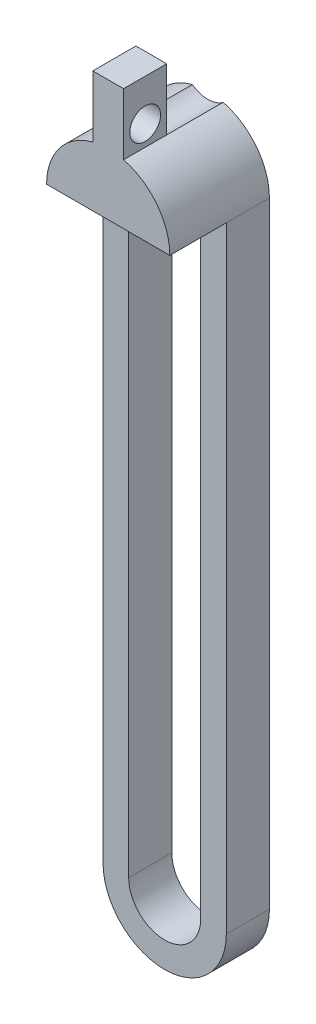
ISO-10303-21;
HEADER;
FILE_DESCRIPTION(('STEP AP214'),'2;1');
FILE_NAME('part.step','',(''),(''),'','','');
FILE_SCHEMA(('AUTOMOTIVE_DESIGN { 1 0 10303 214 1 1 1 1 }'));
ENDSEC;
DATA;
#1=APPLICATION_CONTEXT('core data for automotive mechanical design processes');
#2=APPLICATION_PROTOCOL_DEFINITION('international standard','automotive_design',2000,#1);
#3=PRODUCT_CONTEXT('',#1,'mechanical');
#4=PRODUCT('Part','Part','',(#3));
#5=PRODUCT_RELATED_PRODUCT_CATEGORY('part','',(#4));
#6=PRODUCT_DEFINITION_FORMATION('','',#4);
#7=PRODUCT_DEFINITION_CONTEXT('part definition',#1,'design');
#8=PRODUCT_DEFINITION('design','',#6,#7);
#9=PRODUCT_DEFINITION_SHAPE('','',#8);
#10=(LENGTH_UNIT() NAMED_UNIT(*) SI_UNIT(.MILLI.,.METRE.));
#11=(NAMED_UNIT(*) PLANE_ANGLE_UNIT() SI_UNIT($,.RADIAN.));
#12=(NAMED_UNIT(*) SI_UNIT($,.STERADIAN.) SOLID_ANGLE_UNIT());
#13=UNCERTAINTY_MEASURE_WITH_UNIT(LENGTH_MEASURE(1.E-05),#10,'distance_accuracy_value','');
#14=(GEOMETRIC_REPRESENTATION_CONTEXT(3) GLOBAL_UNCERTAINTY_ASSIGNED_CONTEXT((#13)) GLOBAL_UNIT_ASSIGNED_CONTEXT((#10,
#11,#12)) REPRESENTATION_CONTEXT('',''));
#15=CARTESIAN_POINT('',(0.,0.,0.));
#16=DIRECTION('',(0.,0.,1.));
#17=DIRECTION('',(1.,0.,0.));
#18=AXIS2_PLACEMENT_3D('',#15,#16,#17);
#19=CARTESIAN_POINT('',(1.5,14.9884191493315,4.2));
#20=DIRECTION('',(-1.,0.,0.));
#21=DIRECTION('',(0.,-1.,0.));
#22=AXIS2_PLACEMENT_3D('',#19,#20,#21);
#23=PLANE('',#22);
#24=CARTESIAN_POINT('',(1.5,10.9884191493315,7.6));
#25=DIRECTION('',(1.,0.,0.));
#26=DIRECTION('',(0.,1.,0.));
#27=AXIS2_PLACEMENT_3D('',#24,#25,#26);
#28=CIRCLE('',#27,1.5);
#29=CARTESIAN_POINT('',(1.5,12.4884191493315,7.6));
#30=VERTEX_POINT('',#29);
#31=EDGE_CURVE('E257',#30,#30,#28,.T.);
#32=ORIENTED_EDGE('',*,*,#31,.F.);
#33=EDGE_LOOP('',(#32));
#34=FACE_BOUND('',#33,.T.);
#35=DIRECTION('',(0.,-1.,0.));
#36=VECTOR('',#35,1.);
#37=CARTESIAN_POINT('',(1.5,14.9884191493315,5.5));
#38=LINE('',#37,#36);
#39=CARTESIAN_POINT('',(1.5,14.9884191493315,5.5));
#40=VERTEX_POINT('',#39);
#41=CARTESIAN_POINT('',(1.5,8.98841914933154,5.5));
#42=VERTEX_POINT('',#41);
#43=EDGE_CURVE('E150',#40,#42,#38,.T.);
#44=ORIENTED_EDGE('',*,*,#43,.F.);
#45=DIRECTION('',(0.,0.,-1.));
#46=VECTOR('',#45,1.);
#47=CARTESIAN_POINT('',(1.5,14.9884191493315,4.2));
#48=LINE('',#47,#46);
#49=CARTESIAN_POINT('',(1.5,14.9884191493315,9.7));
#50=VERTEX_POINT('',#49);
#51=EDGE_CURVE('E172',#50,#40,#48,.T.);
#52=ORIENTED_EDGE('',*,*,#51,.F.);
#53=DIRECTION('',(0.,1.,0.));
#54=VECTOR('',#53,1.);
#55=CARTESIAN_POINT('',(1.5,8.98841914933154,9.7));
#56=LINE('',#55,#54);
#57=CARTESIAN_POINT('',(1.5,8.98841914933154,9.7));
#58=VERTEX_POINT('',#57);
#59=EDGE_CURVE('E171',#58,#50,#56,.T.);
#60=ORIENTED_EDGE('',*,*,#59,.F.);
#61=DIRECTION('',(0.,0.,-1.));
#62=VECTOR('',#61,1.);
#63=CARTESIAN_POINT('',(1.5,8.98841914933154,4.2));
#64=LINE('',#63,#62);
#65=EDGE_CURVE('E41',#58,#42,#64,.T.);
#66=ORIENTED_EDGE('',*,*,#65,.T.);
#67=EDGE_LOOP('',(#44,#52,#60,#66));
#68=FACE_BOUND('',#67,.T.);
#69=ADVANCED_FACE('F32',(#34,#68),#23,.F.);
#70=CARTESIAN_POINT('',(-1.5,14.9884191493315,4.2));
#71=DIRECTION('',(0.,-1.,0.));
#72=DIRECTION('',(0.,0.,-1.));
#73=AXIS2_PLACEMENT_3D('',#70,#71,#72);
#74=PLANE('',#73);
#75=DIRECTION('',(1.,0.,0.));
#76=VECTOR('',#75,1.);
#77=CARTESIAN_POINT('',(1.5,14.9884191493315,5.5));
#78=LINE('',#77,#76);
#79=CARTESIAN_POINT('',(-1.5,14.9884191493315,5.5));
#80=VERTEX_POINT('',#79);
#81=EDGE_CURVE('E155',#80,#40,#78,.T.);
#82=ORIENTED_EDGE('',*,*,#81,.F.);
#83=DIRECTION('',(0.,0.,-1.));
#84=VECTOR('',#83,1.);
#85=CARTESIAN_POINT('',(-1.5,14.9884191493315,4.2));
#86=LINE('',#85,#84);
#87=CARTESIAN_POINT('',(-1.5,14.9884191493315,9.7));
#88=VERTEX_POINT('',#87);
#89=EDGE_CURVE('E173',#88,#80,#86,.T.);
#90=ORIENTED_EDGE('',*,*,#89,.F.);
#91=DIRECTION('',(-1.,0.,0.));
#92=VECTOR('',#91,1.);
#93=CARTESIAN_POINT('',(1.5,14.9884191493315,9.7));
#94=LINE('',#93,#92);
#95=EDGE_CURVE('E249',#50,#88,#94,.T.);
#96=ORIENTED_EDGE('',*,*,#95,.F.);
#97=ORIENTED_EDGE('',*,*,#51,.T.);
#98=EDGE_LOOP('',(#82,#90,#96,#97));
#99=FACE_BOUND('',#98,.T.);
#100=ADVANCED_FACE('F275',(#99),#74,.F.);
#101=CARTESIAN_POINT('',(-1.5,8.98841914933154,4.2));
#102=DIRECTION('',(1.,0.,0.));
#103=DIRECTION('',(0.,1.,0.));
#104=AXIS2_PLACEMENT_3D('',#101,#102,#103);
#105=PLANE('',#104);
#106=CARTESIAN_POINT('',(-1.5,10.9884191493315,7.6));
#107=DIRECTION('',(1.,0.,0.));
#108=DIRECTION('',(0.,1.,0.));
#109=AXIS2_PLACEMENT_3D('',#106,#107,#108);
#110=CIRCLE('',#109,1.5);
#111=CARTESIAN_POINT('',(-1.5,12.4884191493315,7.6));
#112=VERTEX_POINT('',#111);
#113=EDGE_CURVE('E36',#112,#112,#110,.T.);
#114=ORIENTED_EDGE('',*,*,#113,.T.);
#115=EDGE_LOOP('',(#114));
#116=FACE_BOUND('',#115,.T.);
#117=DIRECTION('',(0.,1.,0.));
#118=VECTOR('',#117,1.);
#119=CARTESIAN_POINT('',(-1.5,14.9884191493315,5.5));
#120=LINE('',#119,#118);
#121=CARTESIAN_POINT('',(-1.5,8.98841914933154,5.5));
#122=VERTEX_POINT('',#121);
#123=EDGE_CURVE('E149',#122,#80,#120,.T.);
#124=ORIENTED_EDGE('',*,*,#123,.F.);
#125=DIRECTION('',(0.,0.,-1.));
#126=VECTOR('',#125,1.);
#127=CARTESIAN_POINT('',(-1.5,8.98841914933154,4.2));
#128=LINE('',#127,#126);
#129=CARTESIAN_POINT('',(-1.5,8.98841914933154,9.7));
#130=VERTEX_POINT('',#129);
#131=EDGE_CURVE('E178',#130,#122,#128,.T.);
#132=ORIENTED_EDGE('',*,*,#131,.F.);
#133=DIRECTION('',(0.,-1.,0.));
#134=VECTOR('',#133,1.);
#135=CARTESIAN_POINT('',(-1.5,14.9884191493315,9.7));
#136=LINE('',#135,#134);
#137=EDGE_CURVE('E246',#88,#130,#136,.T.);
#138=ORIENTED_EDGE('',*,*,#137,.F.);
#139=ORIENTED_EDGE('',*,*,#89,.T.);
#140=EDGE_LOOP('',(#124,#132,#138,#139));
#141=FACE_BOUND('',#140,.T.);
#142=ADVANCED_FACE('F264',(#116,#141),#105,.F.);
#143=CARTESIAN_POINT('',(0.,3.17378029554191,4.2));
#144=DIRECTION('',(0.,0.,1.));
#145=DIRECTION('',(1.,0.,0.));
#146=AXIS2_PLACEMENT_3D('',#143,#144,#145);
#147=PLANE('',#146);
#148=DIRECTION('',(1.,0.,0.));
#149=VECTOR('',#148,1.);
#150=CARTESIAN_POINT('',(-6.005,3.17378029554187,4.2));
#151=LINE('',#150,#149);
#152=CARTESIAN_POINT('',(-6.005,3.17378029554191,4.2));
#153=VERTEX_POINT('',#152);
#154=CARTESIAN_POINT('',(-3.505,3.17378029554191,4.2));
#155=VERTEX_POINT('',#154);
#156=EDGE_CURVE('E43',#153,#155,#151,.T.);
#157=ORIENTED_EDGE('',*,*,#156,.F.);
#158=DIRECTION('',(0.,-1.,0.));
#159=VECTOR('',#158,1.);
#160=CARTESIAN_POINT('',(-6.005,3.17378029554191,4.2));
#161=LINE('',#160,#159);
#162=CARTESIAN_POINT('',(-6.00499999999999,-56.8262197044581,4.2));
#163=VERTEX_POINT('',#162);
#164=EDGE_CURVE('E195',#153,#163,#161,.T.);
#165=ORIENTED_EDGE('',*,*,#164,.T.);
#166=CARTESIAN_POINT('',(0.,-56.8262197044581,4.2));
#167=DIRECTION('',(0.,0.,1.));
#168=DIRECTION('',(1.,0.,0.));
#169=AXIS2_PLACEMENT_3D('',#166,#167,#168);
#170=CIRCLE('',#169,6.005);
#171=CARTESIAN_POINT('',(6.00500000000001,-56.8262197044581,4.2));
#172=VERTEX_POINT('',#171);
#173=EDGE_CURVE('E206',#163,#172,#170,.T.);
#174=ORIENTED_EDGE('',*,*,#173,.T.);
#175=DIRECTION('',(0.,1.,0.));
#176=VECTOR('',#175,1.);
#177=CARTESIAN_POINT('',(6.005,3.17378029554191,4.2));
#178=LINE('',#177,#176);
#179=CARTESIAN_POINT('',(6.005,3.17378029554191,4.2));
#180=VERTEX_POINT('',#179);
#181=EDGE_CURVE('E192',#172,#180,#178,.T.);
#182=ORIENTED_EDGE('',*,*,#181,.T.);
#183=CARTESIAN_POINT('',(3.505,3.17378029554191,4.2));
#184=VERTEX_POINT('',#183);
#185=EDGE_CURVE('E11',#184,#180,#151,.T.);
#186=ORIENTED_EDGE('',*,*,#185,.F.);
#187=DIRECTION('',(0.,1.,0.));
#188=VECTOR('',#187,1.);
#189=CARTESIAN_POINT('',(3.505,3.17378029554191,4.2));
#190=LINE('',#189,#188);
#191=CARTESIAN_POINT('',(3.50500000000001,-56.8262197044581,4.2));
#192=VERTEX_POINT('',#191);
#193=EDGE_CURVE('E215',#192,#184,#190,.T.);
#194=ORIENTED_EDGE('',*,*,#193,.F.);
#195=CARTESIAN_POINT('',(0.,-56.8262197044581,4.2));
#196=DIRECTION('',(0.,0.,1.));
#197=DIRECTION('',(1.,0.,0.));
#198=AXIS2_PLACEMENT_3D('',#195,#196,#197);
#199=CIRCLE('',#198,3.505);
#200=CARTESIAN_POINT('',(-3.50499999999999,-56.8262197044581,4.2));
#201=VERTEX_POINT('',#200);
#202=EDGE_CURVE('E229',#201,#192,#199,.T.);
#203=ORIENTED_EDGE('',*,*,#202,.F.);
#204=DIRECTION('',(0.,-1.,0.));
#205=VECTOR('',#204,1.);
#206=CARTESIAN_POINT('',(-3.505,3.17378029554191,4.2));
#207=LINE('',#206,#205);
#208=EDGE_CURVE('E231',#155,#201,#207,.T.);
#209=ORIENTED_EDGE('',*,*,#208,.F.);
#210=EDGE_LOOP('',(#157,#165,#174,#182,#186,#194,#203,#209));
#211=FACE_BOUND('',#210,.T.);
#212=ADVANCED_FACE('F285',(#211),#147,.T.);
#213=CARTESIAN_POINT('',(0.,3.17378029554191,0.));
#214=DIRECTION('',(0.,0.,1.));
#215=DIRECTION('',(1.,0.,0.));
#216=AXIS2_PLACEMENT_3D('',#213,#214,#215);
#217=PLANE('',#216);
#218=CARTESIAN_POINT('',(0.,3.17378029554191,0.));
#219=DIRECTION('',(0.,0.,1.));
#220=DIRECTION('',(1.,0.,0.));
#221=AXIS2_PLACEMENT_3D('',#218,#219,#220);
#222=CIRCLE('',#221,6.005);
#223=CARTESIAN_POINT('',(-1.5,8.98841914933154,0.));
#224=VERTEX_POINT('',#223);
#225=CARTESIAN_POINT('',(-6.005,3.17378029554191,0.));
#226=VERTEX_POINT('',#225);
#227=EDGE_CURVE('E200',#224,#226,#222,.T.);
#228=ORIENTED_EDGE('',*,*,#227,.F.);
#229=CARTESIAN_POINT('',(0.,10.9884191493315,0.));
#230=DIRECTION('',(0.,0.,-1.));
#231=DIRECTION('',(-1.,0.,0.));
#232=AXIS2_PLACEMENT_3D('',#229,#230,#231);
#233=CIRCLE('',#232,2.5);
#234=CARTESIAN_POINT('',(1.5,8.98841914933154,0.));
#235=VERTEX_POINT('',#234);
#236=EDGE_CURVE('E159',#235,#224,#233,.T.);
#237=ORIENTED_EDGE('',*,*,#236,.F.);
#238=CARTESIAN_POINT('',(0.,3.17378029554191,0.));
#239=DIRECTION('',(0.,0.,1.));
#240=DIRECTION('',(1.,0.,0.));
#241=AXIS2_PLACEMENT_3D('',#238,#239,#240);
#242=CIRCLE('',#241,6.005);
#243=CARTESIAN_POINT('',(6.005,3.17378029554191,0.));
#244=VERTEX_POINT('',#243);
#245=EDGE_CURVE('E167',#244,#235,#242,.T.);
#246=ORIENTED_EDGE('',*,*,#245,.F.);
#247=DIRECTION('',(0.,1.,0.));
#248=VECTOR('',#247,1.);
#249=CARTESIAN_POINT('',(6.005,3.17378029554191,0.));
#250=LINE('',#249,#248);
#251=CARTESIAN_POINT('',(6.00500000000001,-56.8262197044581,0.));
#252=VERTEX_POINT('',#251);
#253=EDGE_CURVE('E193',#252,#244,#250,.T.);
#254=ORIENTED_EDGE('',*,*,#253,.F.);
#255=CARTESIAN_POINT('',(0.,-56.8262197044581,0.));
#256=DIRECTION('',(0.,0.,1.));
#257=DIRECTION('',(1.,0.,0.));
#258=AXIS2_PLACEMENT_3D('',#255,#256,#257);
#259=CIRCLE('',#258,6.005);
#260=CARTESIAN_POINT('',(-6.00499999999999,-56.8262197044581,0.));
#261=VERTEX_POINT('',#260);
#262=EDGE_CURVE('E196',#261,#252,#259,.T.);
#263=ORIENTED_EDGE('',*,*,#262,.F.);
#264=DIRECTION('',(0.,-1.,0.));
#265=VECTOR('',#264,1.);
#266=CARTESIAN_POINT('',(-6.005,3.17378029554191,0.));
#267=LINE('',#266,#265);
#268=EDGE_CURVE('E198',#226,#261,#267,.T.);
#269=ORIENTED_EDGE('',*,*,#268,.F.);
#270=EDGE_LOOP('',(#228,#237,#246,#254,#263,#269));
#271=FACE_BOUND('',#270,.T.);
#272=CARTESIAN_POINT('',(0.,3.17378029554191,0.));
#273=DIRECTION('',(0.,0.,1.));
#274=DIRECTION('',(1.,0.,0.));
#275=AXIS2_PLACEMENT_3D('',#272,#273,#274);
#276=CIRCLE('',#275,3.505);
#277=CARTESIAN_POINT('',(3.505,3.17378029554191,0.));
#278=VERTEX_POINT('',#277);
#279=CARTESIAN_POINT('',(-3.505,3.17378029554191,0.));
#280=VERTEX_POINT('',#279);
#281=EDGE_CURVE('E59',#278,#280,#276,.T.);
#282=ORIENTED_EDGE('',*,*,#281,.T.);
#283=DIRECTION('',(0.,-1.,0.));
#284=VECTOR('',#283,1.);
#285=CARTESIAN_POINT('',(-3.505,3.17378029554191,0.));
#286=LINE('',#285,#284);
#287=CARTESIAN_POINT('',(-3.50499999999999,-56.8262197044581,0.));
#288=VERTEX_POINT('',#287);
#289=EDGE_CURVE('E223',#280,#288,#286,.T.);
#290=ORIENTED_EDGE('',*,*,#289,.T.);
#291=CARTESIAN_POINT('',(0.,-56.8262197044581,0.));
#292=DIRECTION('',(0.,0.,1.));
#293=DIRECTION('',(1.,0.,0.));
#294=AXIS2_PLACEMENT_3D('',#291,#292,#293);
#295=CIRCLE('',#294,3.505);
#296=CARTESIAN_POINT('',(3.50500000000001,-56.8262197044581,0.));
#297=VERTEX_POINT('',#296);
#298=EDGE_CURVE('E220',#288,#297,#295,.T.);
#299=ORIENTED_EDGE('',*,*,#298,.T.);
#300=DIRECTION('',(0.,1.,0.));
#301=VECTOR('',#300,1.);
#302=CARTESIAN_POINT('',(3.505,3.17378029554191,0.));
#303=LINE('',#302,#301);
#304=EDGE_CURVE('E216',#297,#278,#303,.T.);
#305=ORIENTED_EDGE('',*,*,#304,.T.);
#306=EDGE_LOOP('',(#282,#290,#299,#305));
#307=FACE_BOUND('',#306,.T.);
#308=ADVANCED_FACE('F303',(#271,#307),#217,.F.);
#309=CARTESIAN_POINT('',(0.,3.17378029554191,4.2));
#310=DIRECTION('',(0.,0.,-1.));
#311=DIRECTION('',(-1.,0.,0.));
#312=AXIS2_PLACEMENT_3D('',#309,#310,#311);
#313=CYLINDRICAL_SURFACE('',#312,6.005);
#314=ORIENTED_EDGE('',*,*,#245,.T.);
#315=DIRECTION('',(0.,0.,-1.));
#316=VECTOR('',#315,1.);
#317=CARTESIAN_POINT('',(1.5,8.98841914933154,5.5));
#318=LINE('',#317,#316);
#319=EDGE_CURVE('E143',#42,#235,#318,.T.);
#320=ORIENTED_EDGE('',*,*,#319,.F.);
#321=ORIENTED_EDGE('',*,*,#65,.F.);
#322=CARTESIAN_POINT('',(0.,3.17378029554191,9.7));
#323=DIRECTION('',(0.,0.,1.));
#324=DIRECTION('',(-1.,0.,0.));
#325=AXIS2_PLACEMENT_3D('',#322,#323,#324);
#326=CIRCLE('',#325,6.005);
#327=CARTESIAN_POINT('',(6.005,3.17378029554191,9.7));
#328=VERTEX_POINT('',#327);
#329=EDGE_CURVE('E238',#328,#58,#326,.T.);
#330=ORIENTED_EDGE('',*,*,#329,.F.);
#331=DIRECTION('',(0.,0.,-1.));
#332=VECTOR('',#331,1.);
#333=CARTESIAN_POINT('',(6.005,3.17378029554191,9.7));
#334=LINE('',#333,#332);
#335=EDGE_CURVE('E236',#328,#180,#334,.T.);
#336=ORIENTED_EDGE('',*,*,#335,.T.);
#337=DIRECTION('',(0.,0.,-1.));
#338=VECTOR('',#337,1.);
#339=CARTESIAN_POINT('',(6.005,3.17378029554191,4.2));
#340=LINE('',#339,#338);
#341=EDGE_CURVE('E190',#180,#244,#340,.T.);
#342=ORIENTED_EDGE('',*,*,#341,.T.);
#343=EDGE_LOOP('',(#314,#320,#321,#330,#336,#342));
#344=FACE_BOUND('',#343,.T.);
#345=ADVANCED_FACE('F34',(#344),#313,.T.);
#346=CARTESIAN_POINT('',(0.,3.17378029554191,4.2));
#347=DIRECTION('',(0.,0.,-1.));
#348=DIRECTION('',(-1.,0.,0.));
#349=AXIS2_PLACEMENT_3D('',#346,#347,#348);
#350=CYLINDRICAL_SURFACE('',#349,6.005);
#351=ORIENTED_EDGE('',*,*,#227,.T.);
#352=DIRECTION('',(0.,0.,-1.));
#353=VECTOR('',#352,1.);
#354=CARTESIAN_POINT('',(-6.005,3.17378029554191,4.2));
#355=LINE('',#354,#353);
#356=EDGE_CURVE('E181',#153,#226,#355,.T.);
#357=ORIENTED_EDGE('',*,*,#356,.F.);
#358=DIRECTION('',(0.,0.,-1.));
#359=VECTOR('',#358,1.);
#360=CARTESIAN_POINT('',(-6.005,3.17378029554187,9.7));
#361=LINE('',#360,#359);
#362=CARTESIAN_POINT('',(-6.005,3.17378029554187,9.7));
#363=VERTEX_POINT('',#362);
#364=EDGE_CURVE('E227',#363,#153,#361,.T.);
#365=ORIENTED_EDGE('',*,*,#364,.F.);
#366=CARTESIAN_POINT('',(0.,3.17378029554191,9.7));
#367=DIRECTION('',(0.,0.,1.));
#368=DIRECTION('',(-1.,0.,0.));
#369=AXIS2_PLACEMENT_3D('',#366,#367,#368);
#370=CIRCLE('',#369,6.005);
#371=EDGE_CURVE('E244',#130,#363,#370,.T.);
#372=ORIENTED_EDGE('',*,*,#371,.F.);
#373=ORIENTED_EDGE('',*,*,#131,.T.);
#374=DIRECTION('',(0.,0.,-1.));
#375=VECTOR('',#374,1.);
#376=CARTESIAN_POINT('',(-1.5,8.98841914933154,5.5));
#377=LINE('',#376,#375);
#378=EDGE_CURVE('E146',#122,#224,#377,.T.);
#379=ORIENTED_EDGE('',*,*,#378,.T.);
#380=EDGE_LOOP('',(#351,#357,#365,#372,#373,#379));
#381=FACE_BOUND('',#380,.T.);
#382=ADVANCED_FACE('F286',(#381),#350,.T.);
#383=CARTESIAN_POINT('',(-6.005,3.17378029554191,4.2));
#384=DIRECTION('',(1.,0.,0.));
#385=DIRECTION('',(0.,1.,0.));
#386=AXIS2_PLACEMENT_3D('',#383,#384,#385);
#387=PLANE('',#386);
#388=ORIENTED_EDGE('',*,*,#268,.T.);
#389=DIRECTION('',(0.,0.,-1.));
#390=VECTOR('',#389,1.);
#391=CARTESIAN_POINT('',(-6.00499999999999,-56.8262197044581,4.2));
#392=LINE('',#391,#390);
#393=EDGE_CURVE('E184',#163,#261,#392,.T.);
#394=ORIENTED_EDGE('',*,*,#393,.F.);
#395=ORIENTED_EDGE('',*,*,#164,.F.);
#396=ORIENTED_EDGE('',*,*,#356,.T.);
#397=EDGE_LOOP('',(#388,#394,#395,#396));
#398=FACE_BOUND('',#397,.T.);
#399=ADVANCED_FACE('F289',(#398),#387,.F.);
#400=CARTESIAN_POINT('',(0.,-56.8262197044581,4.2));
#401=DIRECTION('',(0.,0.,-1.));
#402=DIRECTION('',(-1.,0.,0.));
#403=AXIS2_PLACEMENT_3D('',#400,#401,#402);
#404=CYLINDRICAL_SURFACE('',#403,6.005);
#405=ORIENTED_EDGE('',*,*,#262,.T.);
#406=DIRECTION('',(0.,0.,-1.));
#407=VECTOR('',#406,1.);
#408=CARTESIAN_POINT('',(6.00500000000001,-56.8262197044581,4.2));
#409=LINE('',#408,#407);
#410=EDGE_CURVE('E187',#172,#252,#409,.T.);
#411=ORIENTED_EDGE('',*,*,#410,.F.);
#412=ORIENTED_EDGE('',*,*,#173,.F.);
#413=ORIENTED_EDGE('',*,*,#393,.T.);
#414=EDGE_LOOP('',(#405,#411,#412,#413));
#415=FACE_BOUND('',#414,.T.);
#416=ADVANCED_FACE('F293',(#415),#404,.T.);
#417=CARTESIAN_POINT('',(6.005,3.17378029554191,4.2));
#418=DIRECTION('',(-1.,0.,0.));
#419=DIRECTION('',(0.,-1.,0.));
#420=AXIS2_PLACEMENT_3D('',#417,#418,#419);
#421=PLANE('',#420);
#422=ORIENTED_EDGE('',*,*,#253,.T.);
#423=ORIENTED_EDGE('',*,*,#341,.F.);
#424=ORIENTED_EDGE('',*,*,#181,.F.);
#425=ORIENTED_EDGE('',*,*,#410,.T.);
#426=EDGE_LOOP('',(#422,#423,#424,#425));
#427=FACE_BOUND('',#426,.T.);
#428=ADVANCED_FACE('F297',(#427),#421,.F.);
#429=CARTESIAN_POINT('',(0.,3.17378029554191,4.2));
#430=DIRECTION('',(0.,0.,-1.));
#431=DIRECTION('',(-1.,0.,0.));
#432=AXIS2_PLACEMENT_3D('',#429,#430,#431);
#433=CYLINDRICAL_SURFACE('',#432,3.505);
#434=ORIENTED_EDGE('',*,*,#281,.F.);
#435=DIRECTION('',(0.,0.,-1.));
#436=VECTOR('',#435,1.);
#437=CARTESIAN_POINT('',(3.505,3.17378029554191,4.2));
#438=LINE('',#437,#436);
#439=EDGE_CURVE('E213',#184,#278,#438,.T.);
#440=ORIENTED_EDGE('',*,*,#439,.F.);
#441=CARTESIAN_POINT('',(0.,3.17378029554191,4.2));
#442=DIRECTION('',(0.,0.,1.));
#443=DIRECTION('',(1.,0.,0.));
#444=AXIS2_PLACEMENT_3D('',#441,#442,#443);
#445=CIRCLE('',#444,3.505);
#446=EDGE_CURVE('E219',#184,#155,#445,.T.);
#447=ORIENTED_EDGE('',*,*,#446,.T.);
#448=DIRECTION('',(0.,0.,-1.));
#449=VECTOR('',#448,1.);
#450=CARTESIAN_POINT('',(-3.505,3.17378029554191,4.2));
#451=LINE('',#450,#449);
#452=EDGE_CURVE('E203',#155,#280,#451,.T.);
#453=ORIENTED_EDGE('',*,*,#452,.T.);
#454=EDGE_LOOP('',(#434,#440,#447,#453));
#455=FACE_BOUND('',#454,.T.);
#456=ADVANCED_FACE('F301',(#455),#433,.F.);
#457=CARTESIAN_POINT('',(-3.505,3.17378029554191,4.2));
#458=DIRECTION('',(1.,0.,0.));
#459=DIRECTION('',(0.,1.,0.));
#460=AXIS2_PLACEMENT_3D('',#457,#458,#459);
#461=PLANE('',#460);
#462=ORIENTED_EDGE('',*,*,#289,.F.);
#463=ORIENTED_EDGE('',*,*,#452,.F.);
#464=ORIENTED_EDGE('',*,*,#208,.T.);
#465=DIRECTION('',(0.,0.,-1.));
#466=VECTOR('',#465,1.);
#467=CARTESIAN_POINT('',(-3.50499999999999,-56.8262197044581,4.2));
#468=LINE('',#467,#466);
#469=EDGE_CURVE('E210',#201,#288,#468,.T.);
#470=ORIENTED_EDGE('',*,*,#469,.T.);
#471=EDGE_LOOP('',(#462,#463,#464,#470));
#472=FACE_BOUND('',#471,.T.);
#473=ADVANCED_FACE('F312',(#472),#461,.T.);
#474=CARTESIAN_POINT('',(0.,-56.8262197044581,4.2));
#475=DIRECTION('',(0.,0.,-1.));
#476=DIRECTION('',(-1.,0.,0.));
#477=AXIS2_PLACEMENT_3D('',#474,#475,#476);
#478=CYLINDRICAL_SURFACE('',#477,3.505);
#479=ORIENTED_EDGE('',*,*,#298,.F.);
#480=ORIENTED_EDGE('',*,*,#469,.F.);
#481=ORIENTED_EDGE('',*,*,#202,.T.);
#482=DIRECTION('',(0.,0.,-1.));
#483=VECTOR('',#482,1.);
#484=CARTESIAN_POINT('',(3.50500000000001,-56.8262197044581,4.2));
#485=LINE('',#484,#483);
#486=EDGE_CURVE('E51',#192,#297,#485,.T.);
#487=ORIENTED_EDGE('',*,*,#486,.T.);
#488=EDGE_LOOP('',(#479,#480,#481,#487));
#489=FACE_BOUND('',#488,.T.);
#490=ADVANCED_FACE('F315',(#489),#478,.F.);
#491=CARTESIAN_POINT('',(3.505,3.17378029554191,4.2));
#492=DIRECTION('',(-1.,0.,0.));
#493=DIRECTION('',(0.,-1.,0.));
#494=AXIS2_PLACEMENT_3D('',#491,#492,#493);
#495=PLANE('',#494);
#496=ORIENTED_EDGE('',*,*,#304,.F.);
#497=ORIENTED_EDGE('',*,*,#486,.F.);
#498=ORIENTED_EDGE('',*,*,#193,.T.);
#499=ORIENTED_EDGE('',*,*,#439,.T.);
#500=EDGE_LOOP('',(#496,#497,#498,#499));
#501=FACE_BOUND('',#500,.T.);
#502=ADVANCED_FACE('F319',(#501),#495,.T.);
#503=CARTESIAN_POINT('',(0.,3.17378029554191,4.2));
#504=DIRECTION('',(0.,0.,-1.));
#505=DIRECTION('',(-1.,0.,0.));
#506=AXIS2_PLACEMENT_3D('',#503,#504,#505);
#507=PLANE('',#506);
#508=ORIENTED_EDGE('',*,*,#446,.F.);
#509=EDGE_CURVE('E44',#155,#184,#151,.T.);
#510=ORIENTED_EDGE('',*,*,#509,.F.);
#511=EDGE_LOOP('',(#508,#510));
#512=FACE_BOUND('',#511,.T.);
#513=ADVANCED_FACE('F323',(#512),#507,.T.);
#514=CARTESIAN_POINT('',(-6.005,3.17378029554187,9.7));
#515=DIRECTION('',(0.,1.,0.));
#516=DIRECTION('',(-1.,0.,0.));
#517=AXIS2_PLACEMENT_3D('',#514,#515,#516);
#518=PLANE('',#517);
#519=ORIENTED_EDGE('',*,*,#156,.T.);
#520=ORIENTED_EDGE('',*,*,#509,.T.);
#521=ORIENTED_EDGE('',*,*,#185,.T.);
#522=ORIENTED_EDGE('',*,*,#335,.F.);
#523=DIRECTION('',(1.,0.,0.));
#524=VECTOR('',#523,1.);
#525=CARTESIAN_POINT('',(-6.005,3.17378029554187,9.7));
#526=LINE('',#525,#524);
#527=EDGE_CURVE('E242',#363,#328,#526,.T.);
#528=ORIENTED_EDGE('',*,*,#527,.F.);
#529=ORIENTED_EDGE('',*,*,#364,.T.);
#530=EDGE_LOOP('',(#519,#520,#521,#522,#528,#529));
#531=FACE_BOUND('',#530,.T.);
#532=ADVANCED_FACE('F324',(#531),#518,.F.);
#533=CARTESIAN_POINT('',(0.,3.17378029554191,9.7));
#534=DIRECTION('',(0.,0.,-1.));
#535=DIRECTION('',(-1.,0.,0.));
#536=AXIS2_PLACEMENT_3D('',#533,#534,#535);
#537=PLANE('',#536);
#538=ORIENTED_EDGE('',*,*,#59,.T.);
#539=ORIENTED_EDGE('',*,*,#95,.T.);
#540=ORIENTED_EDGE('',*,*,#137,.T.);
#541=ORIENTED_EDGE('',*,*,#371,.T.);
#542=ORIENTED_EDGE('',*,*,#527,.T.);
#543=ORIENTED_EDGE('',*,*,#329,.T.);
#544=EDGE_LOOP('',(#538,#539,#540,#541,#542,#543));
#545=FACE_BOUND('',#544,.T.);
#546=ADVANCED_FACE('F327',(#545),#537,.F.);
#547=CARTESIAN_POINT('',(0.,10.9884191493315,5.5));
#548=DIRECTION('',(0.,0.,-1.));
#549=DIRECTION('',(-1.,0.,0.));
#550=AXIS2_PLACEMENT_3D('',#547,#548,#549);
#551=CYLINDRICAL_SURFACE('',#550,2.5);
#552=ORIENTED_EDGE('',*,*,#236,.T.);
#553=ORIENTED_EDGE('',*,*,#378,.F.);
#554=CARTESIAN_POINT('',(0.,10.9884191493315,5.5));
#555=DIRECTION('',(0.,0.,-1.));
#556=DIRECTION('',(-1.,0.,0.));
#557=AXIS2_PLACEMENT_3D('',#554,#555,#556);
#558=CIRCLE('',#557,2.5);
#559=EDGE_CURVE('E139',#42,#122,#558,.T.);
#560=ORIENTED_EDGE('',*,*,#559,.F.);
#561=ORIENTED_EDGE('',*,*,#319,.T.);
#562=EDGE_LOOP('',(#552,#553,#560,#561));
#563=FACE_BOUND('',#562,.T.);
#564=ADVANCED_FACE('F141',(#563),#551,.F.);
#565=CARTESIAN_POINT('',(0.,10.9884191493315,5.5));
#566=DIRECTION('',(0.,0.,-1.));
#567=DIRECTION('',(-1.,0.,0.));
#568=AXIS2_PLACEMENT_3D('',#565,#566,#567);
#569=PLANE('',#568);
#570=ORIENTED_EDGE('',*,*,#43,.T.);
#571=ORIENTED_EDGE('',*,*,#559,.T.);
#572=ORIENTED_EDGE('',*,*,#123,.T.);
#573=ORIENTED_EDGE('',*,*,#81,.T.);
#574=EDGE_LOOP('',(#570,#571,#572,#573));
#575=FACE_BOUND('',#574,.T.);
#576=ADVANCED_FACE('F153',(#575),#569,.T.);
#577=CARTESIAN_POINT('',(-8.5,10.9884191493315,7.6));
#578=DIRECTION('',(1.,0.,0.));
#579=DIRECTION('',(0.,1.,0.));
#580=AXIS2_PLACEMENT_3D('',#577,#578,#579);
#581=CYLINDRICAL_SURFACE('',#580,1.5);
#582=ORIENTED_EDGE('',*,*,#31,.T.);
#583=EDGE_LOOP('',(#582));
#584=FACE_BOUND('',#583,.T.);
#585=ORIENTED_EDGE('',*,*,#113,.F.);
#586=EDGE_LOOP('',(#585));
#587=FACE_BOUND('',#586,.T.);
#588=ADVANCED_FACE('F267',(#584,#587),#581,.F.);
#589=CLOSED_SHELL('',(#69,#100,#142,#212,#308,#345,#382,#399,#416,#428,#456,#473,#490,#502,#513,
#532,#546,#564,#576,#588));
#590=MANIFOLD_SOLID_BREP('B2',#589);
#591=ADVANCED_BREP_SHAPE_REPRESENTATION('',(#18,#590),#14);
#592=SHAPE_DEFINITION_REPRESENTATION(#9,#591);
ENDSEC;
END-ISO-10303-21;
